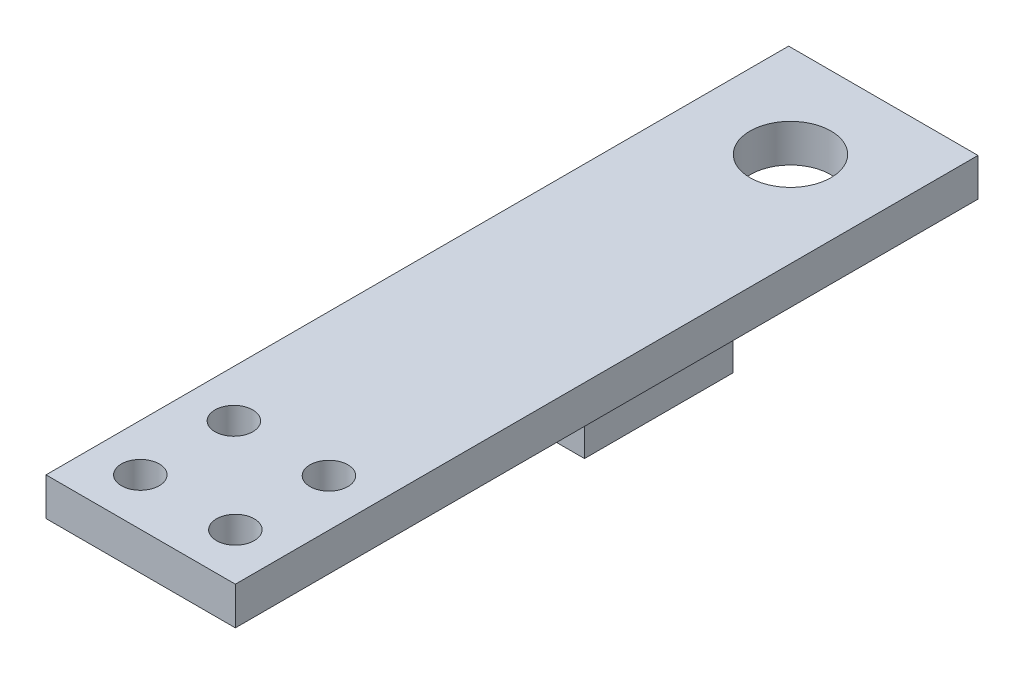
ISO-10303-21;
HEADER;
FILE_DESCRIPTION(('STEP AP214'),'2;1');
FILE_NAME('part.step','',(''),(''),'','','');
FILE_SCHEMA(('AUTOMOTIVE_DESIGN { 1 0 10303 214 1 1 1 1 }'));
ENDSEC;
DATA;
#1=APPLICATION_CONTEXT('core data for automotive mechanical design processes');
#2=APPLICATION_PROTOCOL_DEFINITION('international standard','automotive_design',2000,#1);
#3=PRODUCT_CONTEXT('',#1,'mechanical');
#4=PRODUCT('Part','Part','',(#3));
#5=PRODUCT_RELATED_PRODUCT_CATEGORY('part','',(#4));
#6=PRODUCT_DEFINITION_FORMATION('','',#4);
#7=PRODUCT_DEFINITION_CONTEXT('part definition',#1,'design');
#8=PRODUCT_DEFINITION('design','',#6,#7);
#9=PRODUCT_DEFINITION_SHAPE('','',#8);
#10=(LENGTH_UNIT() NAMED_UNIT(*) SI_UNIT(.MILLI.,.METRE.));
#11=(NAMED_UNIT(*) PLANE_ANGLE_UNIT() SI_UNIT($,.RADIAN.));
#12=(NAMED_UNIT(*) SI_UNIT($,.STERADIAN.) SOLID_ANGLE_UNIT());
#13=UNCERTAINTY_MEASURE_WITH_UNIT(LENGTH_MEASURE(1.E-05),#10,'distance_accuracy_value','');
#14=(GEOMETRIC_REPRESENTATION_CONTEXT(3) GLOBAL_UNCERTAINTY_ASSIGNED_CONTEXT((#13)) GLOBAL_UNIT_ASSIGNED_CONTEXT((#10,
#11,#12)) REPRESENTATION_CONTEXT('',''));
#15=CARTESIAN_POINT('',(0.,0.,0.));
#16=DIRECTION('',(0.,0.,1.));
#17=DIRECTION('',(1.,0.,0.));
#18=AXIS2_PLACEMENT_3D('',#15,#16,#17);
#19=CARTESIAN_POINT('',(0.,1.02,0.));
#20=DIRECTION('',(0.,-1.,0.));
#21=DIRECTION('',(0.,0.,-1.));
#22=AXIS2_PLACEMENT_3D('',#19,#20,#21);
#23=PLANE('',#22);
#24=CARTESIAN_POINT('',(1.28000000000004,1.02,6.20999999999999));
#25=DIRECTION('',(0.,-1.,0.));
#26=DIRECTION('',(0.,0.,-1.));
#27=AXIS2_PLACEMENT_3D('',#24,#25,#26);
#28=CIRCLE('',#27,0.509999999999999);
#29=CARTESIAN_POINT('',(1.28000000000004,1.02,5.69999999999999));
#30=VERTEX_POINT('',#29);
#31=EDGE_CURVE('E240',#30,#30,#28,.T.);
#32=ORIENTED_EDGE('',*,*,#31,.T.);
#33=EDGE_LOOP('',(#32));
#34=FACE_BOUND('',#33,.T.);
#35=CARTESIAN_POINT('',(1.28000000000006,1.02,8.72999999999999));
#36=DIRECTION('',(0.,-1.,0.));
#37=DIRECTION('',(0.,0.,-1.));
#38=AXIS2_PLACEMENT_3D('',#35,#36,#37);
#39=CIRCLE('',#38,0.51);
#40=CARTESIAN_POINT('',(1.28000000000006,1.02,8.21999999999999));
#41=VERTEX_POINT('',#40);
#42=EDGE_CURVE('E246',#41,#41,#39,.T.);
#43=ORIENTED_EDGE('',*,*,#42,.T.);
#44=EDGE_LOOP('',(#43));
#45=FACE_BOUND('',#44,.T.);
#46=DIRECTION('',(-1.,0.,0.));
#47=VECTOR('',#46,1.);
#48=CARTESIAN_POINT('',(2.55,1.02,-10.));
#49=LINE('',#48,#47);
#50=CARTESIAN_POINT('',(2.55,1.02,-10.));
#51=VERTEX_POINT('',#50);
#52=CARTESIAN_POINT('',(-2.55,1.02,-10.));
#53=VERTEX_POINT('',#52);
#54=EDGE_CURVE('E176',#51,#53,#49,.T.);
#55=ORIENTED_EDGE('',*,*,#54,.T.);
#56=DIRECTION('',(0.,0.,-1.));
#57=VECTOR('',#56,1.);
#58=CARTESIAN_POINT('',(-2.55,1.02,10.));
#59=LINE('',#58,#57);
#60=CARTESIAN_POINT('',(-2.55,1.02,10.));
#61=VERTEX_POINT('',#60);
#62=EDGE_CURVE('E279',#61,#53,#59,.T.);
#63=ORIENTED_EDGE('',*,*,#62,.F.);
#64=DIRECTION('',(-1.,0.,0.));
#65=VECTOR('',#64,1.);
#66=CARTESIAN_POINT('',(2.55,1.02,10.));
#67=LINE('',#66,#65);
#68=CARTESIAN_POINT('',(2.55,1.02,10.));
#69=VERTEX_POINT('',#68);
#70=EDGE_CURVE('E282',#69,#61,#67,.T.);
#71=ORIENTED_EDGE('',*,*,#70,.F.);
#72=DIRECTION('',(0.,0.,-1.));
#73=VECTOR('',#72,1.);
#74=CARTESIAN_POINT('',(2.55,1.02,10.));
#75=LINE('',#74,#73);
#76=EDGE_CURVE('E152',#69,#51,#75,.T.);
#77=ORIENTED_EDGE('',*,*,#76,.T.);
#78=EDGE_LOOP('',(#55,#63,#71,#77));
#79=FACE_BOUND('',#78,.T.);
#80=CARTESIAN_POINT('',(0.,1.02,-7.5));
#81=DIRECTION('',(0.,1.,0.));
#82=DIRECTION('',(0.,0.,1.));
#83=AXIS2_PLACEMENT_3D('',#80,#81,#82);
#84=CIRCLE('',#83,1.09);
#85=CARTESIAN_POINT('',(0.,1.02,-6.41));
#86=VERTEX_POINT('',#85);
#87=EDGE_CURVE('E264',#86,#86,#84,.T.);
#88=ORIENTED_EDGE('',*,*,#87,.F.);
#89=EDGE_LOOP('',(#88));
#90=FACE_BOUND('',#89,.T.);
#91=CARTESIAN_POINT('',(-1.28,1.02,6.21));
#92=DIRECTION('',(0.,1.,0.));
#93=DIRECTION('',(0.,0.,1.));
#94=AXIS2_PLACEMENT_3D('',#91,#92,#93);
#95=CIRCLE('',#94,0.509999999999999);
#96=CARTESIAN_POINT('',(-1.28,1.02,6.72));
#97=VERTEX_POINT('',#96);
#98=EDGE_CURVE('E258',#97,#97,#95,.T.);
#99=ORIENTED_EDGE('',*,*,#98,.F.);
#100=EDGE_LOOP('',(#99));
#101=FACE_BOUND('',#100,.T.);
#102=CARTESIAN_POINT('',(-1.28,1.02,8.73));
#103=DIRECTION('',(0.,1.,0.));
#104=DIRECTION('',(0.,0.,1.));
#105=AXIS2_PLACEMENT_3D('',#102,#103,#104);
#106=CIRCLE('',#105,0.51);
#107=CARTESIAN_POINT('',(-1.28,1.02,9.24));
#108=VERTEX_POINT('',#107);
#109=EDGE_CURVE('E252',#108,#108,#106,.T.);
#110=ORIENTED_EDGE('',*,*,#109,.F.);
#111=EDGE_LOOP('',(#110));
#112=FACE_BOUND('',#111,.T.);
#113=ADVANCED_FACE('F135',(#34,#45,#79,#90,#101,#112),#23,.F.);
#114=CARTESIAN_POINT('',(0.,0.,0.));
#115=DIRECTION('',(0.,-1.,0.));
#116=DIRECTION('',(0.,0.,-1.));
#117=AXIS2_PLACEMENT_3D('',#114,#115,#116);
#118=PLANE('',#117);
#119=CARTESIAN_POINT('',(1.28000000000004,0.,6.20999999999999));
#120=DIRECTION('',(0.,-1.,0.));
#121=DIRECTION('',(0.,0.,-1.));
#122=AXIS2_PLACEMENT_3D('',#119,#120,#121);
#123=CIRCLE('',#122,0.509999999999999);
#124=CARTESIAN_POINT('',(1.28000000000004,0.,5.69999999999999));
#125=VERTEX_POINT('',#124);
#126=EDGE_CURVE('E235',#125,#125,#123,.T.);
#127=ORIENTED_EDGE('',*,*,#126,.F.);
#128=EDGE_LOOP('',(#127));
#129=FACE_BOUND('',#128,.T.);
#130=CARTESIAN_POINT('',(1.28000000000006,0.,8.72999999999999));
#131=DIRECTION('',(0.,-1.,0.));
#132=DIRECTION('',(0.,0.,-1.));
#133=AXIS2_PLACEMENT_3D('',#130,#131,#132);
#134=CIRCLE('',#133,0.51);
#135=CARTESIAN_POINT('',(1.28000000000006,0.,8.21999999999999));
#136=VERTEX_POINT('',#135);
#137=EDGE_CURVE('E243',#136,#136,#134,.T.);
#138=ORIENTED_EDGE('',*,*,#137,.F.);
#139=EDGE_LOOP('',(#138));
#140=FACE_BOUND('',#139,.T.);
#141=CARTESIAN_POINT('',(-1.28,0.,6.21));
#142=DIRECTION('',(0.,1.,0.));
#143=DIRECTION('',(0.,0.,1.));
#144=AXIS2_PLACEMENT_3D('',#141,#142,#143);
#145=CIRCLE('',#144,0.509999999999999);
#146=CARTESIAN_POINT('',(-1.28,0.,6.72));
#147=VERTEX_POINT('',#146);
#148=EDGE_CURVE('E255',#147,#147,#145,.T.);
#149=ORIENTED_EDGE('',*,*,#148,.T.);
#150=EDGE_LOOP('',(#149));
#151=FACE_BOUND('',#150,.T.);
#152=DIRECTION('',(0.,0.,1.));
#153=VECTOR('',#152,1.);
#154=CARTESIAN_POINT('',(-1.80248527850466,0.,-4.15));
#155=LINE('',#154,#153);
#156=CARTESIAN_POINT('',(-1.80248527850466,0.,-4.15));
#157=VERTEX_POINT('',#156);
#158=CARTESIAN_POINT('',(-1.80248527850466,0.,-0.149999999999998));
#159=VERTEX_POINT('',#158);
#160=EDGE_CURVE('E275',#157,#159,#155,.T.);
#161=ORIENTED_EDGE('',*,*,#160,.T.);
#162=DIRECTION('',(1.,0.,0.));
#163=VECTOR('',#162,1.);
#164=CARTESIAN_POINT('',(-1.80248527850466,0.,-0.149999999999998));
#165=LINE('',#164,#163);
#166=CARTESIAN_POINT('',(1.80248527850467,0.,-0.149999999999998));
#167=VERTEX_POINT('',#166);
#168=EDGE_CURVE('E210',#159,#167,#165,.T.);
#169=ORIENTED_EDGE('',*,*,#168,.T.);
#170=DIRECTION('',(0.,0.,1.));
#171=VECTOR('',#170,1.);
#172=CARTESIAN_POINT('',(1.80248527850467,0.,-4.15));
#173=LINE('',#172,#171);
#174=CARTESIAN_POINT('',(1.80248527850467,0.,-4.15));
#175=VERTEX_POINT('',#174);
#176=EDGE_CURVE('E270',#175,#167,#173,.T.);
#177=ORIENTED_EDGE('',*,*,#176,.F.);
#178=DIRECTION('',(1.,0.,0.));
#179=VECTOR('',#178,1.);
#180=CARTESIAN_POINT('',(-1.80248527850466,0.,-4.15));
#181=LINE('',#180,#179);
#182=EDGE_CURVE('E273',#157,#175,#181,.T.);
#183=ORIENTED_EDGE('',*,*,#182,.F.);
#184=EDGE_LOOP('',(#161,#169,#177,#183));
#185=FACE_BOUND('',#184,.T.);
#186=DIRECTION('',(-1.,0.,0.));
#187=VECTOR('',#186,1.);
#188=CARTESIAN_POINT('',(2.55,0.,-10.));
#189=LINE('',#188,#187);
#190=CARTESIAN_POINT('',(2.55,0.,-10.));
#191=VERTEX_POINT('',#190);
#192=CARTESIAN_POINT('',(-2.55,0.,-10.));
#193=VERTEX_POINT('',#192);
#194=EDGE_CURVE('E277',#191,#193,#189,.T.);
#195=ORIENTED_EDGE('',*,*,#194,.F.);
#196=DIRECTION('',(0.,0.,-1.));
#197=VECTOR('',#196,1.);
#198=CARTESIAN_POINT('',(2.55,0.,10.));
#199=LINE('',#198,#197);
#200=CARTESIAN_POINT('',(2.55,0.,10.));
#201=VERTEX_POINT('',#200);
#202=EDGE_CURVE('E171',#201,#191,#199,.T.);
#203=ORIENTED_EDGE('',*,*,#202,.F.);
#204=DIRECTION('',(-1.,0.,0.));
#205=VECTOR('',#204,1.);
#206=CARTESIAN_POINT('',(2.55,0.,10.));
#207=LINE('',#206,#205);
#208=CARTESIAN_POINT('',(-2.55,0.,10.));
#209=VERTEX_POINT('',#208);
#210=EDGE_CURVE('E292',#201,#209,#207,.T.);
#211=ORIENTED_EDGE('',*,*,#210,.T.);
#212=DIRECTION('',(0.,0.,-1.));
#213=VECTOR('',#212,1.);
#214=CARTESIAN_POINT('',(-2.55,0.,10.));
#215=LINE('',#214,#213);
#216=EDGE_CURVE('E289',#209,#193,#215,.T.);
#217=ORIENTED_EDGE('',*,*,#216,.T.);
#218=EDGE_LOOP('',(#195,#203,#211,#217));
#219=FACE_BOUND('',#218,.T.);
#220=CARTESIAN_POINT('',(0.,0.,-7.5));
#221=DIRECTION('',(0.,1.,0.));
#222=DIRECTION('',(0.,0.,1.));
#223=AXIS2_PLACEMENT_3D('',#220,#221,#222);
#224=CIRCLE('',#223,1.09);
#225=CARTESIAN_POINT('',(0.,0.,-6.41));
#226=VERTEX_POINT('',#225);
#227=EDGE_CURVE('E261',#226,#226,#224,.T.);
#228=ORIENTED_EDGE('',*,*,#227,.T.);
#229=EDGE_LOOP('',(#228));
#230=FACE_BOUND('',#229,.T.);
#231=CARTESIAN_POINT('',(-1.28,0.,8.73));
#232=DIRECTION('',(0.,1.,0.));
#233=DIRECTION('',(0.,0.,1.));
#234=AXIS2_PLACEMENT_3D('',#231,#232,#233);
#235=CIRCLE('',#234,0.51);
#236=CARTESIAN_POINT('',(-1.28,0.,9.24));
#237=VERTEX_POINT('',#236);
#238=EDGE_CURVE('E249',#237,#237,#235,.T.);
#239=ORIENTED_EDGE('',*,*,#238,.T.);
#240=EDGE_LOOP('',(#239));
#241=FACE_BOUND('',#240,.T.);
#242=ADVANCED_FACE('F305',(#129,#140,#151,#185,#219,#230,#241),#118,.T.);
#243=CARTESIAN_POINT('',(2.55,1.02,-10.));
#244=DIRECTION('',(0.,0.,1.));
#245=DIRECTION('',(1.,0.,0.));
#246=AXIS2_PLACEMENT_3D('',#243,#244,#245);
#247=PLANE('',#246);
#248=ORIENTED_EDGE('',*,*,#194,.T.);
#249=DIRECTION('',(0.,-1.,0.));
#250=VECTOR('',#249,1.);
#251=CARTESIAN_POINT('',(-2.55,1.02,-10.));
#252=LINE('',#251,#250);
#253=EDGE_CURVE('E12',#53,#193,#252,.T.);
#254=ORIENTED_EDGE('',*,*,#253,.F.);
#255=ORIENTED_EDGE('',*,*,#54,.F.);
#256=DIRECTION('',(0.,-1.,0.));
#257=VECTOR('',#256,1.);
#258=CARTESIAN_POINT('',(2.55,1.02,-10.));
#259=LINE('',#258,#257);
#260=EDGE_CURVE('E286',#51,#191,#259,.T.);
#261=ORIENTED_EDGE('',*,*,#260,.T.);
#262=EDGE_LOOP('',(#248,#254,#255,#261));
#263=FACE_BOUND('',#262,.T.);
#264=ADVANCED_FACE('F137',(#263),#247,.F.);
#265=CARTESIAN_POINT('',(-2.55,1.02,10.));
#266=DIRECTION('',(-1.,0.,0.));
#267=DIRECTION('',(0.,0.,1.));
#268=AXIS2_PLACEMENT_3D('',#265,#266,#267);
#269=PLANE('',#268);
#270=ORIENTED_EDGE('',*,*,#216,.F.);
#271=DIRECTION('',(0.,-1.,0.));
#272=VECTOR('',#271,1.);
#273=CARTESIAN_POINT('',(-2.55,1.02,10.));
#274=LINE('',#273,#272);
#275=EDGE_CURVE('E144',#61,#209,#274,.T.);
#276=ORIENTED_EDGE('',*,*,#275,.F.);
#277=ORIENTED_EDGE('',*,*,#62,.T.);
#278=ORIENTED_EDGE('',*,*,#253,.T.);
#279=EDGE_LOOP('',(#270,#276,#277,#278));
#280=FACE_BOUND('',#279,.T.);
#281=ADVANCED_FACE('F302',(#280),#269,.T.);
#282=CARTESIAN_POINT('',(2.55,1.02,10.));
#283=DIRECTION('',(0.,0.,1.));
#284=DIRECTION('',(1.,0.,0.));
#285=AXIS2_PLACEMENT_3D('',#282,#283,#284);
#286=PLANE('',#285);
#287=ORIENTED_EDGE('',*,*,#210,.F.);
#288=DIRECTION('',(0.,-1.,0.));
#289=VECTOR('',#288,1.);
#290=CARTESIAN_POINT('',(2.55,1.02,10.));
#291=LINE('',#290,#289);
#292=EDGE_CURVE('E168',#69,#201,#291,.T.);
#293=ORIENTED_EDGE('',*,*,#292,.F.);
#294=ORIENTED_EDGE('',*,*,#70,.T.);
#295=ORIENTED_EDGE('',*,*,#275,.T.);
#296=EDGE_LOOP('',(#287,#293,#294,#295));
#297=FACE_BOUND('',#296,.T.);
#298=ADVANCED_FACE('F300',(#297),#286,.T.);
#299=CARTESIAN_POINT('',(2.55,1.02,10.));
#300=DIRECTION('',(-1.,0.,0.));
#301=DIRECTION('',(0.,0.,1.));
#302=AXIS2_PLACEMENT_3D('',#299,#300,#301);
#303=PLANE('',#302);
#304=ORIENTED_EDGE('',*,*,#202,.T.);
#305=ORIENTED_EDGE('',*,*,#260,.F.);
#306=ORIENTED_EDGE('',*,*,#76,.F.);
#307=ORIENTED_EDGE('',*,*,#292,.T.);
#308=EDGE_LOOP('',(#304,#305,#306,#307));
#309=FACE_BOUND('',#308,.T.);
#310=ADVANCED_FACE('F308',(#309),#303,.F.);
#311=CARTESIAN_POINT('',(0.,1.02,-7.5));
#312=DIRECTION('',(0.,-1.,0.));
#313=DIRECTION('',(0.,0.,-1.));
#314=AXIS2_PLACEMENT_3D('',#311,#312,#313);
#315=CYLINDRICAL_SURFACE('',#314,1.09);
#316=ORIENTED_EDGE('',*,*,#87,.T.);
#317=EDGE_LOOP('',(#316));
#318=FACE_BOUND('',#317,.T.);
#319=ORIENTED_EDGE('',*,*,#227,.F.);
#320=EDGE_LOOP('',(#319));
#321=FACE_BOUND('',#320,.T.);
#322=ADVANCED_FACE('F339',(#318,#321),#315,.F.);
#323=CARTESIAN_POINT('',(-1.28,1.02,6.21));
#324=DIRECTION('',(0.,-1.,0.));
#325=DIRECTION('',(0.,0.,-1.));
#326=AXIS2_PLACEMENT_3D('',#323,#324,#325);
#327=CYLINDRICAL_SURFACE('',#326,0.509999999999999);
#328=ORIENTED_EDGE('',*,*,#98,.T.);
#329=EDGE_LOOP('',(#328));
#330=FACE_BOUND('',#329,.T.);
#331=ORIENTED_EDGE('',*,*,#148,.F.);
#332=EDGE_LOOP('',(#331));
#333=FACE_BOUND('',#332,.T.);
#334=ADVANCED_FACE('F323',(#330,#333),#327,.F.);
#335=CARTESIAN_POINT('',(-1.28,1.02,8.73));
#336=DIRECTION('',(0.,-1.,0.));
#337=DIRECTION('',(0.,0.,-1.));
#338=AXIS2_PLACEMENT_3D('',#335,#336,#337);
#339=CYLINDRICAL_SURFACE('',#338,0.51);
#340=ORIENTED_EDGE('',*,*,#109,.T.);
#341=EDGE_LOOP('',(#340));
#342=FACE_BOUND('',#341,.T.);
#343=ORIENTED_EDGE('',*,*,#238,.F.);
#344=EDGE_LOOP('',(#343));
#345=FACE_BOUND('',#344,.T.);
#346=ADVANCED_FACE('F319',(#342,#345),#339,.F.);
#347=CARTESIAN_POINT('',(1.28000000000006,1.02,8.72999999999999));
#348=DIRECTION('',(0.,-1.,0.));
#349=DIRECTION('',(0.,0.,-1.));
#350=AXIS2_PLACEMENT_3D('',#347,#348,#349);
#351=CYLINDRICAL_SURFACE('',#350,0.51);
#352=ORIENTED_EDGE('',*,*,#42,.F.);
#353=EDGE_LOOP('',(#352));
#354=FACE_BOUND('',#353,.T.);
#355=ORIENTED_EDGE('',*,*,#137,.T.);
#356=EDGE_LOOP('',(#355));
#357=FACE_BOUND('',#356,.T.);
#358=ADVANCED_FACE('F322',(#354,#357),#351,.F.);
#359=CARTESIAN_POINT('',(1.28000000000004,1.02,6.20999999999999));
#360=DIRECTION('',(0.,-1.,0.));
#361=DIRECTION('',(0.,0.,-1.));
#362=AXIS2_PLACEMENT_3D('',#359,#360,#361);
#363=CYLINDRICAL_SURFACE('',#362,0.509999999999999);
#364=ORIENTED_EDGE('',*,*,#31,.F.);
#365=EDGE_LOOP('',(#364));
#366=FACE_BOUND('',#365,.T.);
#367=ORIENTED_EDGE('',*,*,#126,.T.);
#368=EDGE_LOOP('',(#367));
#369=FACE_BOUND('',#368,.T.);
#370=ADVANCED_FACE('F377',(#366,#369),#363,.F.);
#371=CARTESIAN_POINT('',(-1.80248527850466,-1.5,-4.15));
#372=DIRECTION('',(-1.,0.,0.));
#373=DIRECTION('',(0.,0.,1.));
#374=AXIS2_PLACEMENT_3D('',#371,#372,#373);
#375=PLANE('',#374);
#376=DIRECTION('',(0.,1.,0.));
#377=VECTOR('',#376,1.);
#378=CARTESIAN_POINT('',(-1.80248527850466,-1.5,-0.149999999999998));
#379=LINE('',#378,#377);
#380=CARTESIAN_POINT('',(-1.80248527850466,-1.5,-0.149999999999998));
#381=VERTEX_POINT('',#380);
#382=EDGE_CURVE('E205',#381,#159,#379,.T.);
#383=ORIENTED_EDGE('',*,*,#382,.T.);
#384=ORIENTED_EDGE('',*,*,#160,.F.);
#385=DIRECTION('',(0.,1.,0.));
#386=VECTOR('',#385,1.);
#387=CARTESIAN_POINT('',(-1.80248527850466,-1.5,-4.15));
#388=LINE('',#387,#386);
#389=CARTESIAN_POINT('',(-1.80248527850466,-1.5,-4.15));
#390=VERTEX_POINT('',#389);
#391=EDGE_CURVE('E229',#390,#157,#388,.T.);
#392=ORIENTED_EDGE('',*,*,#391,.F.);
#393=DIRECTION('',(0.,0.,1.));
#394=VECTOR('',#393,1.);
#395=CARTESIAN_POINT('',(-1.80248527850466,-1.5,-4.15));
#396=LINE('',#395,#394);
#397=EDGE_CURVE('E222',#390,#381,#396,.T.);
#398=ORIENTED_EDGE('',*,*,#397,.T.);
#399=EDGE_LOOP('',(#383,#384,#392,#398));
#400=FACE_BOUND('',#399,.T.);
#401=ADVANCED_FACE('F227',(#400),#375,.T.);
#402=CARTESIAN_POINT('',(-1.80248527850466,-1.5,-4.15));
#403=DIRECTION('',(0.,0.,-1.));
#404=DIRECTION('',(-1.,0.,0.));
#405=AXIS2_PLACEMENT_3D('',#402,#403,#404);
#406=PLANE('',#405);
#407=ORIENTED_EDGE('',*,*,#391,.T.);
#408=ORIENTED_EDGE('',*,*,#182,.T.);
#409=DIRECTION('',(0.,1.,0.));
#410=VECTOR('',#409,1.);
#411=CARTESIAN_POINT('',(1.80248527850467,-1.5,-4.15));
#412=LINE('',#411,#410);
#413=CARTESIAN_POINT('',(1.80248527850467,-1.5,-4.15));
#414=VERTEX_POINT('',#413);
#415=EDGE_CURVE('E236',#414,#175,#412,.T.);
#416=ORIENTED_EDGE('',*,*,#415,.F.);
#417=DIRECTION('',(-1.,0.,0.));
#418=VECTOR('',#417,1.);
#419=CARTESIAN_POINT('',(-1.80248527850466,-1.5,-4.15));
#420=LINE('',#419,#418);
#421=EDGE_CURVE('E215',#414,#390,#420,.T.);
#422=ORIENTED_EDGE('',*,*,#421,.T.);
#423=EDGE_LOOP('',(#407,#408,#416,#422));
#424=FACE_BOUND('',#423,.T.);
#425=ADVANCED_FACE('F393',(#424),#406,.T.);
#426=CARTESIAN_POINT('',(1.80248527850467,-1.5,-4.15));
#427=DIRECTION('',(1.,0.,0.));
#428=DIRECTION('',(0.,0.,-1.));
#429=AXIS2_PLACEMENT_3D('',#426,#427,#428);
#430=PLANE('',#429);
#431=ORIENTED_EDGE('',*,*,#415,.T.);
#432=ORIENTED_EDGE('',*,*,#176,.T.);
#433=DIRECTION('',(0.,1.,0.));
#434=VECTOR('',#433,1.);
#435=CARTESIAN_POINT('',(1.80248527850467,-1.5,-0.149999999999998));
#436=LINE('',#435,#434);
#437=CARTESIAN_POINT('',(1.80248527850467,-1.5,-0.149999999999998));
#438=VERTEX_POINT('',#437);
#439=EDGE_CURVE('E214',#438,#167,#436,.T.);
#440=ORIENTED_EDGE('',*,*,#439,.F.);
#441=DIRECTION('',(0.,0.,-1.));
#442=VECTOR('',#441,1.);
#443=CARTESIAN_POINT('',(1.80248527850467,-1.5,-4.15));
#444=LINE('',#443,#442);
#445=EDGE_CURVE('E225',#438,#414,#444,.T.);
#446=ORIENTED_EDGE('',*,*,#445,.T.);
#447=EDGE_LOOP('',(#431,#432,#440,#446));
#448=FACE_BOUND('',#447,.T.);
#449=ADVANCED_FACE('F400',(#448),#430,.T.);
#450=CARTESIAN_POINT('',(-1.80248527850466,-1.5,-0.149999999999998));
#451=DIRECTION('',(0.,0.,1.));
#452=DIRECTION('',(1.,0.,0.));
#453=AXIS2_PLACEMENT_3D('',#450,#451,#452);
#454=PLANE('',#453);
#455=ORIENTED_EDGE('',*,*,#439,.T.);
#456=ORIENTED_EDGE('',*,*,#168,.F.);
#457=ORIENTED_EDGE('',*,*,#382,.F.);
#458=DIRECTION('',(1.,0.,0.));
#459=VECTOR('',#458,1.);
#460=CARTESIAN_POINT('',(-1.80248527850466,-1.5,-0.149999999999998));
#461=LINE('',#460,#459);
#462=EDGE_CURVE('E208',#381,#438,#461,.T.);
#463=ORIENTED_EDGE('',*,*,#462,.T.);
#464=EDGE_LOOP('',(#455,#456,#457,#463));
#465=FACE_BOUND('',#464,.T.);
#466=ADVANCED_FACE('F207',(#465),#454,.T.);
#467=CARTESIAN_POINT('',(0.,-1.5,0.));
#468=DIRECTION('',(0.,1.,0.));
#469=DIRECTION('',(0.,0.,1.));
#470=AXIS2_PLACEMENT_3D('',#467,#468,#469);
#471=PLANE('',#470);
#472=ORIENTED_EDGE('',*,*,#397,.F.);
#473=ORIENTED_EDGE('',*,*,#421,.F.);
#474=ORIENTED_EDGE('',*,*,#445,.F.);
#475=ORIENTED_EDGE('',*,*,#462,.F.);
#476=EDGE_LOOP('',(#472,#473,#474,#475));
#477=FACE_BOUND('',#476,.T.);
#478=ADVANCED_FACE('F220',(#477),#471,.F.);
#479=CLOSED_SHELL('',(#113,#242,#264,#281,#298,#310,#322,#334,#346,#358,#370,#401,#425,#449,
#466,#478));
#480=MANIFOLD_SOLID_BREP('B2',#479);
#481=ADVANCED_BREP_SHAPE_REPRESENTATION('',(#18,#480),#14);
#482=SHAPE_DEFINITION_REPRESENTATION(#9,#481);
ENDSEC;
END-ISO-10303-21;
